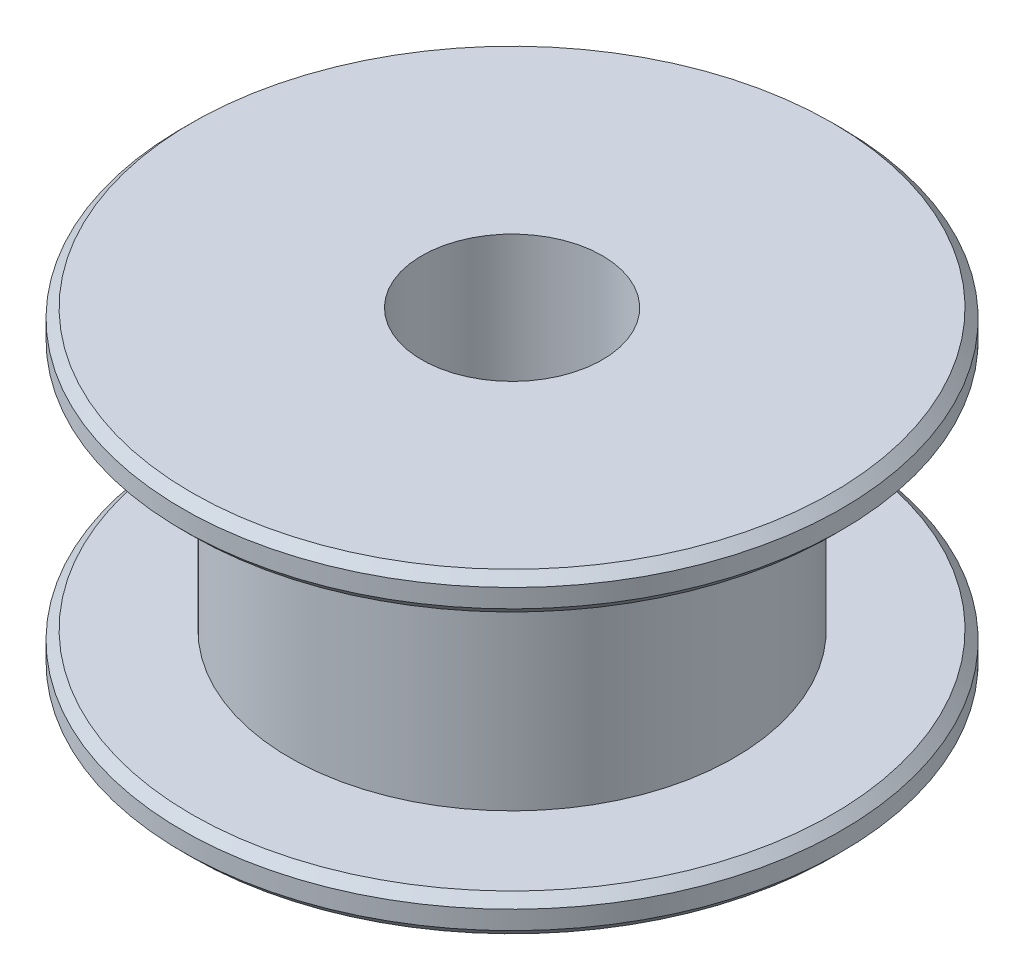
ISO-10303-21;
HEADER;
FILE_DESCRIPTION(('STEP AP214'),'2;1');
FILE_NAME('part.step','',(''),(''),'','','');
FILE_SCHEMA(('AUTOMOTIVE_DESIGN { 1 0 10303 214 1 1 1 1 }'));
ENDSEC;
DATA;
#1=APPLICATION_CONTEXT('core data for automotive mechanical design processes');
#2=APPLICATION_PROTOCOL_DEFINITION('international standard','automotive_design',2000,#1);
#3=PRODUCT_CONTEXT('',#1,'mechanical');
#4=PRODUCT('Part','Part','',(#3));
#5=PRODUCT_RELATED_PRODUCT_CATEGORY('part','',(#4));
#6=PRODUCT_DEFINITION_FORMATION('','',#4);
#7=PRODUCT_DEFINITION_CONTEXT('part definition',#1,'design');
#8=PRODUCT_DEFINITION('design','',#6,#7);
#9=PRODUCT_DEFINITION_SHAPE('','',#8);
#10=(LENGTH_UNIT() NAMED_UNIT(*) SI_UNIT(.MILLI.,.METRE.));
#11=(NAMED_UNIT(*) PLANE_ANGLE_UNIT() SI_UNIT($,.RADIAN.));
#12=(NAMED_UNIT(*) SI_UNIT($,.STERADIAN.) SOLID_ANGLE_UNIT());
#13=UNCERTAINTY_MEASURE_WITH_UNIT(LENGTH_MEASURE(1.E-05),#10,'distance_accuracy_value','');
#14=(GEOMETRIC_REPRESENTATION_CONTEXT(3) GLOBAL_UNCERTAINTY_ASSIGNED_CONTEXT((#13)) GLOBAL_UNIT_ASSIGNED_CONTEXT((#10,
#11,#12)) REPRESENTATION_CONTEXT('',''));
#15=CARTESIAN_POINT('',(0.,0.,0.));
#16=DIRECTION('',(0.,0.,1.));
#17=DIRECTION('',(1.,0.,0.));
#18=AXIS2_PLACEMENT_3D('',#15,#16,#17);
#19=CARTESIAN_POINT('',(8.7884,8.6614,0.));
#20=DIRECTION('',(0.,1.,0.));
#21=DIRECTION('',(0.,0.,1.));
#22=AXIS2_PLACEMENT_3D('',#19,#20,#21);
#23=PLANE('',#22);
#24=CARTESIAN_POINT('',(0.,8.6614,0.));
#25=DIRECTION('',(0.,-1.,0.));
#26=DIRECTION('',(0.,0.,-1.));
#27=AXIS2_PLACEMENT_3D('',#24,#25,#26);
#28=CIRCLE('',#27,2.4765);
#29=CARTESIAN_POINT('',(0.,8.6614,-2.4765));
#30=VERTEX_POINT('',#29);
#31=EDGE_CURVE('E10',#30,#30,#28,.T.);
#32=ORIENTED_EDGE('',*,*,#31,.T.);
#33=EDGE_LOOP('',(#32));
#34=FACE_BOUND('',#33,.T.);
#35=CARTESIAN_POINT('',(0.,8.6614,0.));
#36=DIRECTION('',(0.,-1.,0.));
#37=DIRECTION('',(0.,0.,-1.));
#38=AXIS2_PLACEMENT_3D('',#35,#36,#37);
#39=CIRCLE('',#38,8.7884);
#40=CARTESIAN_POINT('',(0.,8.6614,-8.7884));
#41=VERTEX_POINT('',#40);
#42=EDGE_CURVE('E72',#41,#41,#39,.T.);
#43=ORIENTED_EDGE('',*,*,#42,.F.);
#44=EDGE_LOOP('',(#43));
#45=FACE_BOUND('',#44,.T.);
#46=ADVANCED_FACE('F32',(#34,#45),#23,.T.);
#47=CARTESIAN_POINT('',(0.,8.6614,0.));
#48=DIRECTION('',(0.,-1.,0.));
#49=DIRECTION('',(0.,0.,-1.));
#50=AXIS2_PLACEMENT_3D('',#47,#48,#49);
#51=CYLINDRICAL_SURFACE('',#50,2.4765);
#52=CARTESIAN_POINT('',(0.,0.,0.));
#53=DIRECTION('',(0.,-1.,0.));
#54=DIRECTION('',(0.,0.,-1.));
#55=AXIS2_PLACEMENT_3D('',#52,#53,#54);
#56=CIRCLE('',#55,2.4765);
#57=CARTESIAN_POINT('',(0.,0.,-2.4765));
#58=VERTEX_POINT('',#57);
#59=EDGE_CURVE('E38',#58,#58,#56,.T.);
#60=ORIENTED_EDGE('',*,*,#59,.T.);
#61=EDGE_LOOP('',(#60));
#62=FACE_BOUND('',#61,.T.);
#63=ORIENTED_EDGE('',*,*,#31,.F.);
#64=EDGE_LOOP('',(#63));
#65=FACE_BOUND('',#64,.T.);
#66=ADVANCED_FACE('F80',(#62,#65),#51,.F.);
#67=CARTESIAN_POINT('',(2.4765,0.,0.));
#68=DIRECTION('',(0.,-1.,0.));
#69=DIRECTION('',(0.,0.,-1.));
#70=AXIS2_PLACEMENT_3D('',#67,#68,#69);
#71=PLANE('',#70);
#72=CARTESIAN_POINT('',(0.,0.,0.));
#73=DIRECTION('',(0.,-1.,0.));
#74=DIRECTION('',(0.,0.,-1.));
#75=AXIS2_PLACEMENT_3D('',#72,#73,#74);
#76=CIRCLE('',#75,8.7884);
#77=CARTESIAN_POINT('',(0.,0.,-8.7884));
#78=VERTEX_POINT('',#77);
#79=EDGE_CURVE('E42',#78,#78,#76,.T.);
#80=ORIENTED_EDGE('',*,*,#79,.T.);
#81=EDGE_LOOP('',(#80));
#82=FACE_BOUND('',#81,.T.);
#83=ORIENTED_EDGE('',*,*,#59,.F.);
#84=EDGE_LOOP('',(#83));
#85=FACE_BOUND('',#84,.T.);
#86=ADVANCED_FACE('F84',(#82,#85),#71,.T.);
#87=CARTESIAN_POINT('',(0.,0.,0.));
#88=DIRECTION('',(0.,1.,0.));
#89=DIRECTION('',(0.,0.,1.));
#90=AXIS2_PLACEMENT_3D('',#87,#88,#89);
#91=CONICAL_SURFACE('',#90,8.7884,0.785398163397448);
#92=CARTESIAN_POINT('',(0.,0.254000000000001,0.));
#93=DIRECTION('',(0.,-1.,0.));
#94=DIRECTION('',(0.,0.,-1.));
#95=AXIS2_PLACEMENT_3D('',#92,#93,#94);
#96=CIRCLE('',#95,9.0424);
#97=CARTESIAN_POINT('',(0.,0.254000000000001,-9.0424));
#98=VERTEX_POINT('',#97);
#99=EDGE_CURVE('E46',#98,#98,#96,.T.);
#100=ORIENTED_EDGE('',*,*,#99,.T.);
#101=EDGE_LOOP('',(#100));
#102=FACE_BOUND('',#101,.T.);
#103=ORIENTED_EDGE('',*,*,#79,.F.);
#104=EDGE_LOOP('',(#103));
#105=FACE_BOUND('',#104,.T.);
#106=ADVANCED_FACE('F88',(#102,#105),#91,.T.);
#107=CARTESIAN_POINT('',(0.,8.6614,0.));
#108=DIRECTION('',(0.,-1.,0.));
#109=DIRECTION('',(0.,0.,-1.));
#110=AXIS2_PLACEMENT_3D('',#107,#108,#109);
#111=CYLINDRICAL_SURFACE('',#110,9.04239999999999);
#112=CARTESIAN_POINT('',(0.,0.762000000000001,0.));
#113=DIRECTION('',(0.,-1.,0.));
#114=DIRECTION('',(0.,0.,-1.));
#115=AXIS2_PLACEMENT_3D('',#112,#113,#114);
#116=CIRCLE('',#115,9.04239999999998);
#117=CARTESIAN_POINT('',(0.,0.762000000000001,-9.04239999999998));
#118=VERTEX_POINT('',#117);
#119=EDGE_CURVE('E51',#118,#118,#116,.T.);
#120=ORIENTED_EDGE('',*,*,#119,.T.);
#121=EDGE_LOOP('',(#120));
#122=FACE_BOUND('',#121,.T.);
#123=ORIENTED_EDGE('',*,*,#99,.F.);
#124=EDGE_LOOP('',(#123));
#125=FACE_BOUND('',#124,.T.);
#126=ADVANCED_FACE('F95',(#122,#125),#111,.T.);
#127=CARTESIAN_POINT('',(0.,0.762000000000001,0.));
#128=DIRECTION('',(0.,-1.,0.));
#129=DIRECTION('',(0.,0.,-1.));
#130=AXIS2_PLACEMENT_3D('',#127,#128,#129);
#131=CONICAL_SURFACE('',#130,9.04239999999998,0.785398163397404);
#132=CARTESIAN_POINT('',(0.,1.016,0.));
#133=DIRECTION('',(0.,-1.,0.));
#134=DIRECTION('',(0.,0.,-1.));
#135=AXIS2_PLACEMENT_3D('',#132,#133,#134);
#136=CIRCLE('',#135,8.7884);
#137=CARTESIAN_POINT('',(0.,1.016,-8.7884));
#138=VERTEX_POINT('',#137);
#139=EDGE_CURVE('E54',#138,#138,#136,.T.);
#140=ORIENTED_EDGE('',*,*,#139,.T.);
#141=EDGE_LOOP('',(#140));
#142=FACE_BOUND('',#141,.T.);
#143=ORIENTED_EDGE('',*,*,#119,.F.);
#144=EDGE_LOOP('',(#143));
#145=FACE_BOUND('',#144,.T.);
#146=ADVANCED_FACE('F99',(#142,#145),#131,.T.);
#147=CARTESIAN_POINT('',(8.7884,1.016,0.));
#148=DIRECTION('',(0.,1.,0.));
#149=DIRECTION('',(0.,0.,1.));
#150=AXIS2_PLACEMENT_3D('',#147,#148,#149);
#151=PLANE('',#150);
#152=CARTESIAN_POINT('',(0.,1.016,0.));
#153=DIRECTION('',(0.,-1.,0.));
#154=DIRECTION('',(0.,0.,-1.));
#155=AXIS2_PLACEMENT_3D('',#152,#153,#154);
#156=CIRCLE('',#155,6.096);
#157=CARTESIAN_POINT('',(0.,1.016,-6.096));
#158=VERTEX_POINT('',#157);
#159=EDGE_CURVE('E57',#158,#158,#156,.T.);
#160=ORIENTED_EDGE('',*,*,#159,.T.);
#161=EDGE_LOOP('',(#160));
#162=FACE_BOUND('',#161,.T.);
#163=ORIENTED_EDGE('',*,*,#139,.F.);
#164=EDGE_LOOP('',(#163));
#165=FACE_BOUND('',#164,.T.);
#166=ADVANCED_FACE('F103',(#162,#165),#151,.T.);
#167=CARTESIAN_POINT('',(0.,8.6614,0.));
#168=DIRECTION('',(0.,-1.,0.));
#169=DIRECTION('',(0.,0.,-1.));
#170=AXIS2_PLACEMENT_3D('',#167,#168,#169);
#171=CYLINDRICAL_SURFACE('',#170,6.096);
#172=CARTESIAN_POINT('',(0.,7.6454,0.));
#173=DIRECTION('',(0.,-1.,0.));
#174=DIRECTION('',(0.,0.,-1.));
#175=AXIS2_PLACEMENT_3D('',#172,#173,#174);
#176=CIRCLE('',#175,6.096);
#177=CARTESIAN_POINT('',(0.,7.6454,-6.096));
#178=VERTEX_POINT('',#177);
#179=EDGE_CURVE('E60',#178,#178,#176,.T.);
#180=ORIENTED_EDGE('',*,*,#179,.T.);
#181=EDGE_LOOP('',(#180));
#182=FACE_BOUND('',#181,.T.);
#183=ORIENTED_EDGE('',*,*,#159,.F.);
#184=EDGE_LOOP('',(#183));
#185=FACE_BOUND('',#184,.T.);
#186=ADVANCED_FACE('F107',(#182,#185),#171,.T.);
#187=CARTESIAN_POINT('',(6.096,7.6454,0.));
#188=DIRECTION('',(0.,-1.,0.));
#189=DIRECTION('',(0.,0.,-1.));
#190=AXIS2_PLACEMENT_3D('',#187,#188,#189);
#191=PLANE('',#190);
#192=CARTESIAN_POINT('',(0.,7.6454,0.));
#193=DIRECTION('',(0.,-1.,0.));
#194=DIRECTION('',(0.,0.,-1.));
#195=AXIS2_PLACEMENT_3D('',#192,#193,#194);
#196=CIRCLE('',#195,8.7884);
#197=CARTESIAN_POINT('',(0.,7.6454,-8.7884));
#198=VERTEX_POINT('',#197);
#199=EDGE_CURVE('E63',#198,#198,#196,.T.);
#200=ORIENTED_EDGE('',*,*,#199,.T.);
#201=EDGE_LOOP('',(#200));
#202=FACE_BOUND('',#201,.T.);
#203=ORIENTED_EDGE('',*,*,#179,.F.);
#204=EDGE_LOOP('',(#203));
#205=FACE_BOUND('',#204,.T.);
#206=ADVANCED_FACE('F111',(#202,#205),#191,.T.);
#207=CARTESIAN_POINT('',(0.,7.6454,0.));
#208=DIRECTION('',(0.,1.,0.));
#209=DIRECTION('',(0.,0.,1.));
#210=AXIS2_PLACEMENT_3D('',#207,#208,#209);
#211=CONICAL_SURFACE('',#210,8.7884,0.785398163397418);
#212=CARTESIAN_POINT('',(0.,7.8994,0.));
#213=DIRECTION('',(0.,-1.,0.));
#214=DIRECTION('',(0.,0.,-1.));
#215=AXIS2_PLACEMENT_3D('',#212,#213,#214);
#216=CIRCLE('',#215,9.04239999999999);
#217=CARTESIAN_POINT('',(0.,7.8994,-9.04239999999999));
#218=VERTEX_POINT('',#217);
#219=EDGE_CURVE('E66',#218,#218,#216,.T.);
#220=ORIENTED_EDGE('',*,*,#219,.T.);
#221=EDGE_LOOP('',(#220));
#222=FACE_BOUND('',#221,.T.);
#223=ORIENTED_EDGE('',*,*,#199,.F.);
#224=EDGE_LOOP('',(#223));
#225=FACE_BOUND('',#224,.T.);
#226=ADVANCED_FACE('F115',(#222,#225),#211,.T.);
#227=CARTESIAN_POINT('',(0.,8.6614,0.));
#228=DIRECTION('',(0.,-1.,0.));
#229=DIRECTION('',(0.,0.,-1.));
#230=AXIS2_PLACEMENT_3D('',#227,#228,#229);
#231=CYLINDRICAL_SURFACE('',#230,9.04239999999999);
#232=CARTESIAN_POINT('',(0.,8.4074,0.));
#233=DIRECTION('',(0.,-1.,0.));
#234=DIRECTION('',(0.,0.,-1.));
#235=AXIS2_PLACEMENT_3D('',#232,#233,#234);
#236=CIRCLE('',#235,9.0424);
#237=CARTESIAN_POINT('',(0.,8.4074,-9.0424));
#238=VERTEX_POINT('',#237);
#239=EDGE_CURVE('E69',#238,#238,#236,.T.);
#240=ORIENTED_EDGE('',*,*,#239,.T.);
#241=EDGE_LOOP('',(#240));
#242=FACE_BOUND('',#241,.T.);
#243=ORIENTED_EDGE('',*,*,#219,.F.);
#244=EDGE_LOOP('',(#243));
#245=FACE_BOUND('',#244,.T.);
#246=ADVANCED_FACE('F119',(#242,#245),#231,.T.);
#247=CARTESIAN_POINT('',(0.,8.4074,0.));
#248=DIRECTION('',(0.,-1.,0.));
#249=DIRECTION('',(0.,0.,-1.));
#250=AXIS2_PLACEMENT_3D('',#247,#248,#249);
#251=CONICAL_SURFACE('',#250,9.0424,0.785398163397452);
#252=ORIENTED_EDGE('',*,*,#42,.T.);
#253=EDGE_LOOP('',(#252));
#254=FACE_BOUND('',#253,.T.);
#255=ORIENTED_EDGE('',*,*,#239,.F.);
#256=EDGE_LOOP('',(#255));
#257=FACE_BOUND('',#256,.T.);
#258=ADVANCED_FACE('F76',(#254,#257),#251,.T.);
#259=CLOSED_SHELL('',(#46,#66,#86,#106,#126,#146,#166,#186,#206,#226,#246,#258));
#260=MANIFOLD_SOLID_BREP('B2',#259);
#261=ADVANCED_BREP_SHAPE_REPRESENTATION('',(#18,#260),#14);
#262=SHAPE_DEFINITION_REPRESENTATION(#9,#261);
ENDSEC;
END-ISO-10303-21;
